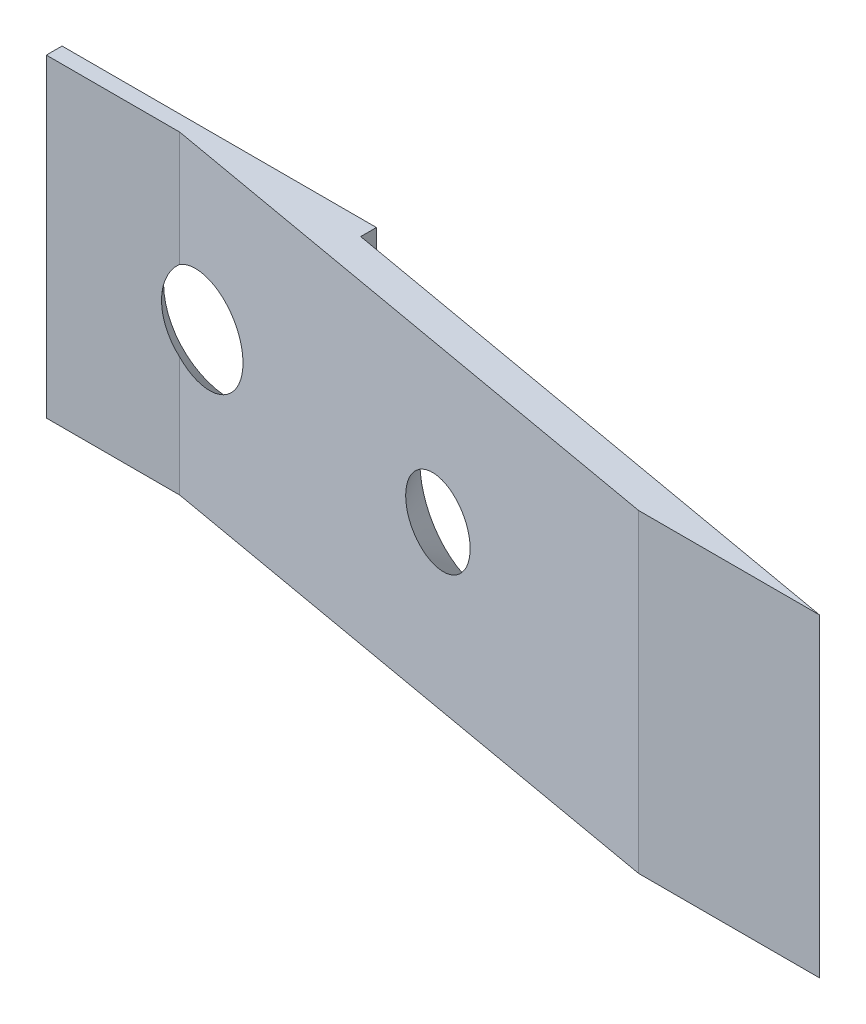
ISO-10303-21;
HEADER;
FILE_DESCRIPTION(('STEP AP214'),'2;1');
FILE_NAME('part.step','',(''),(''),'','','');
FILE_SCHEMA(('AUTOMOTIVE_DESIGN { 1 0 10303 214 1 1 1 1 }'));
ENDSEC;
DATA;
#1=APPLICATION_CONTEXT('core data for automotive mechanical design processes');
#2=APPLICATION_PROTOCOL_DEFINITION('international standard','automotive_design',2000,#1);
#3=PRODUCT_CONTEXT('',#1,'mechanical');
#4=PRODUCT('Part','Part','',(#3));
#5=PRODUCT_RELATED_PRODUCT_CATEGORY('part','',(#4));
#6=PRODUCT_DEFINITION_FORMATION('','',#4);
#7=PRODUCT_DEFINITION_CONTEXT('part definition',#1,'design');
#8=PRODUCT_DEFINITION('design','',#6,#7);
#9=PRODUCT_DEFINITION_SHAPE('','',#8);
#10=(LENGTH_UNIT() NAMED_UNIT(*) SI_UNIT(.MILLI.,.METRE.));
#11=(NAMED_UNIT(*) PLANE_ANGLE_UNIT() SI_UNIT($,.RADIAN.));
#12=(NAMED_UNIT(*) SI_UNIT($,.STERADIAN.) SOLID_ANGLE_UNIT());
#13=UNCERTAINTY_MEASURE_WITH_UNIT(LENGTH_MEASURE(1.E-05),#10,'distance_accuracy_value','');
#14=(GEOMETRIC_REPRESENTATION_CONTEXT(3) GLOBAL_UNCERTAINTY_ASSIGNED_CONTEXT((#13)) GLOBAL_UNIT_ASSIGNED_CONTEXT((#10,
#11,#12)) REPRESENTATION_CONTEXT('',''));
#15=CARTESIAN_POINT('',(0.,0.,0.));
#16=DIRECTION('',(0.,0.,1.));
#17=DIRECTION('',(1.,0.,0.));
#18=AXIS2_PLACEMENT_3D('',#15,#16,#17);
#19=CARTESIAN_POINT('',(0.,0.,0.5));
#20=DIRECTION('',(1.,0.,0.));
#21=DIRECTION('',(0.,1.,0.));
#22=AXIS2_PLACEMENT_3D('',#19,#20,#21);
#23=PLANE('',#22);
#24=DIRECTION('',(0.,-1.,0.));
#25=VECTOR('',#24,1.);
#26=CARTESIAN_POINT('',(0.,0.,0.));
#27=LINE('',#26,#25);
#28=CARTESIAN_POINT('',(0.,0.,0.));
#29=VERTEX_POINT('',#28);
#30=CARTESIAN_POINT('',(0.,-10.,0.));
#31=VERTEX_POINT('',#30);
#32=EDGE_CURVE('E121',#29,#31,#27,.T.);
#33=ORIENTED_EDGE('',*,*,#32,.T.);
#34=DIRECTION('',(0.,0.,-1.));
#35=VECTOR('',#34,1.);
#36=CARTESIAN_POINT('',(0.,-10.,0.5));
#37=LINE('',#36,#35);
#38=CARTESIAN_POINT('',(0.,-10.,0.5));
#39=VERTEX_POINT('',#38);
#40=EDGE_CURVE('E52',#39,#31,#37,.T.);
#41=ORIENTED_EDGE('',*,*,#40,.F.);
#42=DIRECTION('',(0.,-1.,0.));
#43=VECTOR('',#42,1.);
#44=CARTESIAN_POINT('',(0.,0.,0.5));
#45=LINE('',#44,#43);
#46=CARTESIAN_POINT('',(0.,0.,0.5));
#47=VERTEX_POINT('',#46);
#48=EDGE_CURVE('E138',#47,#39,#45,.T.);
#49=ORIENTED_EDGE('',*,*,#48,.F.);
#50=DIRECTION('',(0.,0.,-1.));
#51=VECTOR('',#50,1.);
#52=CARTESIAN_POINT('',(0.,0.,0.5));
#53=LINE('',#52,#51);
#54=EDGE_CURVE('E152',#47,#29,#53,.T.);
#55=ORIENTED_EDGE('',*,*,#54,.T.);
#56=EDGE_LOOP('',(#33,#41,#49,#55));
#57=FACE_BOUND('',#56,.T.);
#58=ADVANCED_FACE('F43',(#57),#23,.F.);
#59=CARTESIAN_POINT('',(0.,-10.,0.5));
#60=DIRECTION('',(0.,1.,0.));
#61=DIRECTION('',(0.,0.,1.));
#62=AXIS2_PLACEMENT_3D('',#59,#60,#61);
#63=PLANE('',#62);
#64=DIRECTION('',(1.,0.,0.));
#65=VECTOR('',#64,1.);
#66=CARTESIAN_POINT('',(0.,-10.,0.));
#67=LINE('',#66,#65);
#68=CARTESIAN_POINT('',(10.,-10.,0.));
#69=VERTEX_POINT('',#68);
#70=EDGE_CURVE('E126',#31,#69,#67,.T.);
#71=ORIENTED_EDGE('',*,*,#70,.T.);
#72=DIRECTION('',(0.,0.,-1.));
#73=VECTOR('',#72,1.);
#74=CARTESIAN_POINT('',(10.,-10.,0.5));
#75=LINE('',#74,#73);
#76=CARTESIAN_POINT('',(10.,-10.,0.5));
#77=VERTEX_POINT('',#76);
#78=EDGE_CURVE('E168',#77,#69,#75,.T.);
#79=ORIENTED_EDGE('',*,*,#78,.F.);
#80=DIRECTION('',(0.984807753012208,0.,0.173648177666931));
#81=VECTOR('',#80,1.);
#82=CARTESIAN_POINT('',(27.7265395542197,-10.,3.62566719800476));
#83=LINE('',#82,#81);
#84=CARTESIAN_POINT('',(27.7265395542197,-10.,3.62566719800476));
#85=VERTEX_POINT('',#84);
#86=EDGE_CURVE('E113',#77,#85,#83,.T.);
#87=ORIENTED_EDGE('',*,*,#86,.T.);
#88=DIRECTION('',(-1.,0.,0.));
#89=VECTOR('',#88,1.);
#90=CARTESIAN_POINT('',(21.9677690710761,-10.,3.62566719800476));
#91=LINE('',#90,#89);
#92=CARTESIAN_POINT('',(21.9677690710761,-10.,3.62566719800476));
#93=VERTEX_POINT('',#92);
#94=EDGE_CURVE('E203',#85,#93,#91,.T.);
#95=ORIENTED_EDGE('',*,*,#94,.T.);
#96=DIRECTION('',(-0.984807753012208,0.,-0.173648177666931));
#97=VECTOR('',#96,1.);
#98=CARTESIAN_POINT('',(4.2412295168564,-10.,0.5));
#99=LINE('',#98,#97);
#100=CARTESIAN_POINT('',(4.2412295168564,-10.,0.5));
#101=VERTEX_POINT('',#100);
#102=EDGE_CURVE('E131',#93,#101,#99,.T.);
#103=ORIENTED_EDGE('',*,*,#102,.T.);
#104=DIRECTION('',(1.,0.,0.));
#105=VECTOR('',#104,1.);
#106=CARTESIAN_POINT('',(0.,-10.,0.5));
#107=LINE('',#106,#105);
#108=EDGE_CURVE('E142',#39,#101,#107,.T.);
#109=ORIENTED_EDGE('',*,*,#108,.F.);
#110=ORIENTED_EDGE('',*,*,#40,.T.);
#111=EDGE_LOOP('',(#71,#79,#87,#95,#103,#109,#110));
#112=FACE_BOUND('',#111,.T.);
#113=ADVANCED_FACE('F176',(#112),#63,.F.);
#114=CARTESIAN_POINT('',(10.,0.,0.5));
#115=DIRECTION('',(-1.,0.,0.));
#116=DIRECTION('',(0.,-1.,0.));
#117=AXIS2_PLACEMENT_3D('',#114,#115,#116);
#118=PLANE('',#117);
#119=DIRECTION('',(0.,1.,0.));
#120=VECTOR('',#119,1.);
#121=CARTESIAN_POINT('',(10.,0.,0.));
#122=LINE('',#121,#120);
#123=CARTESIAN_POINT('',(10.,0.,0.));
#124=VERTEX_POINT('',#123);
#125=EDGE_CURVE('E156',#69,#124,#122,.T.);
#126=ORIENTED_EDGE('',*,*,#125,.T.);
#127=DIRECTION('',(0.,0.,-1.));
#128=VECTOR('',#127,1.);
#129=CARTESIAN_POINT('',(10.,0.,0.5));
#130=LINE('',#129,#128);
#131=CARTESIAN_POINT('',(10.,0.,0.5));
#132=VERTEX_POINT('',#131);
#133=EDGE_CURVE('E164',#132,#124,#130,.T.);
#134=ORIENTED_EDGE('',*,*,#133,.F.);
#135=DIRECTION('',(0.,1.,0.));
#136=VECTOR('',#135,1.);
#137=CARTESIAN_POINT('',(10.,0.,0.5));
#138=LINE('',#137,#136);
#139=EDGE_CURVE('E146',#77,#132,#138,.T.);
#140=ORIENTED_EDGE('',*,*,#139,.F.);
#141=ORIENTED_EDGE('',*,*,#78,.T.);
#142=EDGE_LOOP('',(#126,#134,#140,#141));
#143=FACE_BOUND('',#142,.T.);
#144=ADVANCED_FACE('F187',(#143),#118,.F.);
#145=CARTESIAN_POINT('',(0.,0.,0.5));
#146=DIRECTION('',(0.,-1.,0.));
#147=DIRECTION('',(0.,0.,-1.));
#148=AXIS2_PLACEMENT_3D('',#145,#146,#147);
#149=PLANE('',#148);
#150=DIRECTION('',(-1.,0.,0.));
#151=VECTOR('',#150,1.);
#152=CARTESIAN_POINT('',(0.,0.,0.));
#153=LINE('',#152,#151);
#154=EDGE_CURVE('E143',#124,#29,#153,.T.);
#155=ORIENTED_EDGE('',*,*,#154,.T.);
#156=ORIENTED_EDGE('',*,*,#54,.F.);
#157=DIRECTION('',(-1.,0.,0.));
#158=VECTOR('',#157,1.);
#159=CARTESIAN_POINT('',(0.,0.,0.5));
#160=LINE('',#159,#158);
#161=CARTESIAN_POINT('',(4.2412295168564,0.,0.5));
#162=VERTEX_POINT('',#161);
#163=EDGE_CURVE('E150',#162,#47,#160,.T.);
#164=ORIENTED_EDGE('',*,*,#163,.F.);
#165=DIRECTION('',(-0.984807753012208,0.,-0.173648177666931));
#166=VECTOR('',#165,1.);
#167=CARTESIAN_POINT('',(4.2412295168564,0.,0.5));
#168=LINE('',#167,#166);
#169=CARTESIAN_POINT('',(21.9677690710761,0.,3.62566719800476));
#170=VERTEX_POINT('',#169);
#171=EDGE_CURVE('E119',#170,#162,#168,.T.);
#172=ORIENTED_EDGE('',*,*,#171,.F.);
#173=DIRECTION('',(-1.,0.,0.));
#174=VECTOR('',#173,1.);
#175=CARTESIAN_POINT('',(21.9677690710761,0.,3.62566719800476));
#176=LINE('',#175,#174);
#177=CARTESIAN_POINT('',(27.7265395542197,0.,3.62566719800476));
#178=VERTEX_POINT('',#177);
#179=EDGE_CURVE('E196',#178,#170,#176,.T.);
#180=ORIENTED_EDGE('',*,*,#179,.F.);
#181=DIRECTION('',(0.984807753012208,0.,0.173648177666931));
#182=VECTOR('',#181,1.);
#183=CARTESIAN_POINT('',(27.7265395542197,0.,3.62566719800476));
#184=LINE('',#183,#182);
#185=EDGE_CURVE('E194',#132,#178,#184,.T.);
#186=ORIENTED_EDGE('',*,*,#185,.F.);
#187=ORIENTED_EDGE('',*,*,#133,.T.);
#188=EDGE_LOOP('',(#155,#156,#164,#172,#180,#186,#187));
#189=FACE_BOUND('',#188,.T.);
#190=ADVANCED_FACE('F191',(#189),#149,.F.);
#191=CARTESIAN_POINT('',(0.,0.,0.5));
#192=DIRECTION('',(0.,0.,1.));
#193=DIRECTION('',(1.,0.,0.));
#194=AXIS2_PLACEMENT_3D('',#191,#192,#193);
#195=PLANE('',#194);
#196=CARTESIAN_POINT('',(5.3625164013596,-4.92129239402616,0.5));
#197=DIRECTION('',(0.,0.,1.));
#198=DIRECTION('',(1.,0.,0.));
#199=AXIS2_PLACEMENT_3D('',#196,#197,#198);
#200=CIRCLE('',#199,1.69895663109189);
#201=CARTESIAN_POINT('',(4.2412295168564,-3.64490320691581,0.5));
#202=VERTEX_POINT('',#201);
#203=CARTESIAN_POINT('',(4.2412295168564,-6.1976815811365,0.5));
#204=VERTEX_POINT('',#203);
#205=EDGE_CURVE('E57',#202,#204,#200,.T.);
#206=ORIENTED_EDGE('',*,*,#205,.F.);
#207=DIRECTION('',(0.,-1.,0.));
#208=VECTOR('',#207,1.);
#209=CARTESIAN_POINT('',(4.2412295168564,0.,0.5));
#210=LINE('',#209,#208);
#211=EDGE_CURVE('E64',#162,#202,#210,.T.);
#212=ORIENTED_EDGE('',*,*,#211,.F.);
#213=ORIENTED_EDGE('',*,*,#163,.T.);
#214=ORIENTED_EDGE('',*,*,#48,.T.);
#215=ORIENTED_EDGE('',*,*,#108,.T.);
#216=EDGE_CURVE('E111',#204,#101,#210,.T.);
#217=ORIENTED_EDGE('',*,*,#216,.F.);
#218=EDGE_LOOP('',(#206,#212,#213,#214,#215,#217));
#219=FACE_BOUND('',#218,.T.);
#220=ADVANCED_FACE('F109',(#219),#195,.T.);
#221=CARTESIAN_POINT('',(0.,0.,0.));
#222=DIRECTION('',(0.,0.,1.));
#223=DIRECTION('',(1.,0.,0.));
#224=AXIS2_PLACEMENT_3D('',#221,#222,#223);
#225=PLANE('',#224);
#226=CARTESIAN_POINT('',(5.3625164013596,-4.92129239402616,0.));
#227=DIRECTION('',(0.,0.,-1.));
#228=DIRECTION('',(-1.,0.,0.));
#229=AXIS2_PLACEMENT_3D('',#226,#227,#228);
#230=CIRCLE('',#229,2.1336);
#231=CARTESIAN_POINT('',(3.2289164013596,-4.92129239402616,0.));
#232=VERTEX_POINT('',#231);
#233=EDGE_CURVE('E114',#232,#232,#230,.T.);
#234=ORIENTED_EDGE('',*,*,#233,.F.);
#235=EDGE_LOOP('',(#234));
#236=FACE_BOUND('',#235,.T.);
#237=ORIENTED_EDGE('',*,*,#32,.F.);
#238=ORIENTED_EDGE('',*,*,#154,.F.);
#239=ORIENTED_EDGE('',*,*,#125,.F.);
#240=ORIENTED_EDGE('',*,*,#70,.F.);
#241=EDGE_LOOP('',(#237,#238,#239,#240));
#242=FACE_BOUND('',#241,.T.);
#243=ADVANCED_FACE('F184',(#236,#242),#225,.F.);
#244=CARTESIAN_POINT('',(4.2412295168564,0.,0.5));
#245=DIRECTION('',(-0.173648177666931,0.,0.984807753012208));
#246=DIRECTION('',(0.984807753012208,0.,0.173648177666931));
#247=AXIS2_PLACEMENT_3D('',#244,#245,#246);
#248=PLANE('',#247);
#249=CARTESIAN_POINT('',(14.215212857593,-4.87940747069672,2.25868236810863));
#250=DIRECTION('',(-0.173648177666931,0.,0.984807753012208));
#251=DIRECTION('',(0.984807753012208,0.,0.173648177666931));
#252=AXIS2_PLACEMENT_3D('',#249,#250,#251);
#253=CIRCLE('',#252,1.26431326218376);
#254=CARTESIAN_POINT('',(15.4603183604277,-4.87940747069672,2.47822806208697));
#255=VERTEX_POINT('',#254);
#256=EDGE_CURVE('E46',#255,#255,#253,.T.);
#257=ORIENTED_EDGE('',*,*,#256,.F.);
#258=EDGE_LOOP('',(#257));
#259=FACE_BOUND('',#258,.T.);
#260=CARTESIAN_POINT('',(5.12281481140233,-4.92129239402616,0.655447273224268));
#261=DIRECTION('',(-0.173648177666931,0.,0.984807753012208));
#262=DIRECTION('',(-0.984807753012208,0.,-0.173648177666931));
#263=AXIS2_PLACEMENT_3D('',#260,#261,#262);
#264=ELLIPSE('',#263,1.5879529514924,1.5453486156079);
#265=EDGE_CURVE('E11',#204,#202,#264,.T.);
#266=ORIENTED_EDGE('',*,*,#265,.F.);
#267=ORIENTED_EDGE('',*,*,#216,.T.);
#268=ORIENTED_EDGE('',*,*,#102,.F.);
#269=DIRECTION('',(0.,-1.,0.));
#270=VECTOR('',#269,1.);
#271=CARTESIAN_POINT('',(21.9677690710761,0.,3.62566719800476));
#272=LINE('',#271,#270);
#273=EDGE_CURVE('E128',#170,#93,#272,.T.);
#274=ORIENTED_EDGE('',*,*,#273,.F.);
#275=ORIENTED_EDGE('',*,*,#171,.T.);
#276=ORIENTED_EDGE('',*,*,#211,.T.);
#277=EDGE_LOOP('',(#266,#267,#268,#274,#275,#276));
#278=FACE_BOUND('',#277,.T.);
#279=ADVANCED_FACE('F117',(#259,#278),#248,.T.);
#280=CARTESIAN_POINT('',(21.9677690710761,0.,3.62566719800476));
#281=DIRECTION('',(0.,0.,1.));
#282=DIRECTION('',(1.,0.,0.));
#283=AXIS2_PLACEMENT_3D('',#280,#281,#282);
#284=PLANE('',#283);
#285=ORIENTED_EDGE('',*,*,#94,.F.);
#286=DIRECTION('',(0.,-1.,0.));
#287=VECTOR('',#286,1.);
#288=CARTESIAN_POINT('',(27.7265395542197,0.,3.62566719800476));
#289=LINE('',#288,#287);
#290=EDGE_CURVE('E135',#178,#85,#289,.T.);
#291=ORIENTED_EDGE('',*,*,#290,.F.);
#292=ORIENTED_EDGE('',*,*,#179,.T.);
#293=ORIENTED_EDGE('',*,*,#273,.T.);
#294=EDGE_LOOP('',(#285,#291,#292,#293));
#295=FACE_BOUND('',#294,.T.);
#296=ADVANCED_FACE('F216',(#295),#284,.T.);
#297=CARTESIAN_POINT('',(27.7265395542197,0.,3.62566719800476));
#298=DIRECTION('',(0.173648177666931,0.,-0.984807753012208));
#299=DIRECTION('',(-0.984807753012208,0.,-0.173648177666931));
#300=AXIS2_PLACEMENT_3D('',#297,#298,#299);
#301=PLANE('',#300);
#302=CARTESIAN_POINT('',(14.3888610352599,-4.87940747069672,1.27387461509642));
#303=DIRECTION('',(0.173648177666931,0.,-0.984807753012208));
#304=DIRECTION('',(-0.984807753012208,0.,-0.173648177666931));
#305=AXIS2_PLACEMENT_3D('',#302,#303,#304);
#306=CIRCLE('',#305,2.1336);
#307=CARTESIAN_POINT('',(12.2876752134331,-4.87940747069672,0.903378863226251));
#308=VERTEX_POINT('',#307);
#309=EDGE_CURVE('E342',#308,#308,#306,.T.);
#310=ORIENTED_EDGE('',*,*,#309,.F.);
#311=EDGE_LOOP('',(#310));
#312=FACE_BOUND('',#311,.T.);
#313=ORIENTED_EDGE('',*,*,#86,.F.);
#314=ORIENTED_EDGE('',*,*,#139,.T.);
#315=ORIENTED_EDGE('',*,*,#185,.T.);
#316=ORIENTED_EDGE('',*,*,#290,.T.);
#317=EDGE_LOOP('',(#313,#314,#315,#316));
#318=FACE_BOUND('',#317,.T.);
#319=ADVANCED_FACE('F217',(#312,#318),#301,.T.);
#320=CARTESIAN_POINT('',(5.3625164013596,-4.92129239402616,0.));
#321=DIRECTION('',(0.,0.,-1.));
#322=DIRECTION('',(-1.,0.,0.));
#323=AXIS2_PLACEMENT_3D('',#320,#321,#322);
#324=CONICAL_SURFACE('',#323,2.1336,0.715584993317674);
#325=ORIENTED_EDGE('',*,*,#205,.T.);
#326=ORIENTED_EDGE('',*,*,#265,.T.);
#327=EDGE_LOOP('',(#325,#326));
#328=FACE_BOUND('',#327,.T.);
#329=ORIENTED_EDGE('',*,*,#233,.T.);
#330=EDGE_LOOP('',(#329));
#331=FACE_BOUND('',#330,.T.);
#332=ADVANCED_FACE('F105',(#328,#331),#324,.F.);
#333=CARTESIAN_POINT('',(14.3888610352599,-4.87940747069672,1.27387461509642));
#334=DIRECTION('',(0.173648177666931,0.,-0.984807753012208));
#335=DIRECTION('',(-0.984807753012208,0.,-0.173648177666931));
#336=AXIS2_PLACEMENT_3D('',#333,#334,#335);
#337=CONICAL_SURFACE('',#336,2.1336,0.715584993317679);
#338=ORIENTED_EDGE('',*,*,#256,.T.);
#339=EDGE_LOOP('',(#338));
#340=FACE_BOUND('',#339,.T.);
#341=ORIENTED_EDGE('',*,*,#309,.T.);
#342=EDGE_LOOP('',(#341));
#343=FACE_BOUND('',#342,.T.);
#344=ADVANCED_FACE('F225',(#340,#343),#337,.F.);
#345=CLOSED_SHELL('',(#58,#113,#144,#190,#220,#243,#279,#296,#319,#332,#344));
#346=MANIFOLD_SOLID_BREP('B2',#345);
#347=ADVANCED_BREP_SHAPE_REPRESENTATION('',(#18,#346),#14);
#348=SHAPE_DEFINITION_REPRESENTATION(#9,#347);
ENDSEC;
END-ISO-10303-21;
